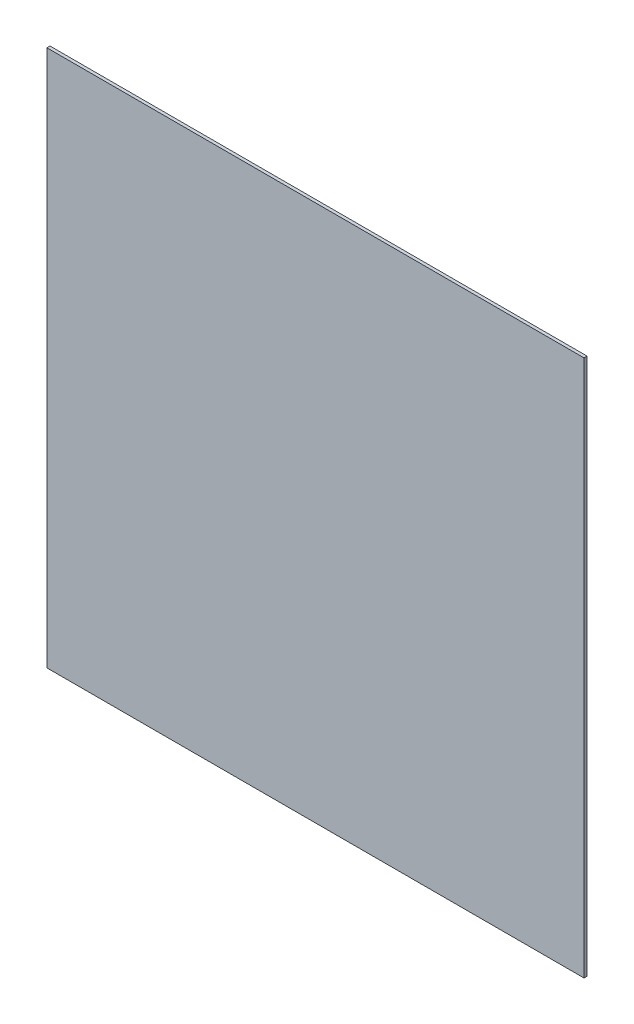
ISO-10303-21;
HEADER;
FILE_DESCRIPTION(('STEP AP214'),'2;1');
FILE_NAME('part.step','',(''),(''),'','','');
FILE_SCHEMA(('AUTOMOTIVE_DESIGN { 1 0 10303 214 1 1 1 1 }'));
ENDSEC;
DATA;
#1=APPLICATION_CONTEXT('core data for automotive mechanical design processes');
#2=APPLICATION_PROTOCOL_DEFINITION('international standard','automotive_design',2000,#1);
#3=PRODUCT_CONTEXT('',#1,'mechanical');
#4=PRODUCT('Part','Part','',(#3));
#5=PRODUCT_RELATED_PRODUCT_CATEGORY('part','',(#4));
#6=PRODUCT_DEFINITION_FORMATION('','',#4);
#7=PRODUCT_DEFINITION_CONTEXT('part definition',#1,'design');
#8=PRODUCT_DEFINITION('design','',#6,#7);
#9=PRODUCT_DEFINITION_SHAPE('','',#8);
#10=(LENGTH_UNIT() NAMED_UNIT(*) SI_UNIT(.MILLI.,.METRE.));
#11=(NAMED_UNIT(*) PLANE_ANGLE_UNIT() SI_UNIT($,.RADIAN.));
#12=(NAMED_UNIT(*) SI_UNIT($,.STERADIAN.) SOLID_ANGLE_UNIT());
#13=UNCERTAINTY_MEASURE_WITH_UNIT(LENGTH_MEASURE(1.E-05),#10,'distance_accuracy_value','');
#14=(GEOMETRIC_REPRESENTATION_CONTEXT(3) GLOBAL_UNCERTAINTY_ASSIGNED_CONTEXT((#13)) GLOBAL_UNIT_ASSIGNED_CONTEXT((#10,
#11,#12)) REPRESENTATION_CONTEXT('',''));
#15=CARTESIAN_POINT('',(0.,0.,0.));
#16=DIRECTION('',(0.,0.,1.));
#17=DIRECTION('',(1.,0.,0.));
#18=AXIS2_PLACEMENT_3D('',#15,#16,#17);
#19=CARTESIAN_POINT('',(-1830.,-1830.,21.));
#20=DIRECTION('',(0.,1.,0.));
#21=DIRECTION('',(0.,0.,1.));
#22=AXIS2_PLACEMENT_3D('',#19,#20,#21);
#23=PLANE('',#22);
#24=DIRECTION('',(1.,0.,0.));
#25=VECTOR('',#24,1.);
#26=CARTESIAN_POINT('',(-1830.,-1830.,0.));
#27=LINE('',#26,#25);
#28=CARTESIAN_POINT('',(-1830.,-1830.,0.));
#29=VERTEX_POINT('',#28);
#30=CARTESIAN_POINT('',(1830.,-1830.,0.));
#31=VERTEX_POINT('',#30);
#32=EDGE_CURVE('E98',#29,#31,#27,.T.);
#33=ORIENTED_EDGE('',*,*,#32,.T.);
#34=DIRECTION('',(0.,0.,-1.));
#35=VECTOR('',#34,1.);
#36=CARTESIAN_POINT('',(1830.,-1830.,21.));
#37=LINE('',#36,#35);
#38=CARTESIAN_POINT('',(1830.,-1830.,21.));
#39=VERTEX_POINT('',#38);
#40=EDGE_CURVE('E11',#39,#31,#37,.T.);
#41=ORIENTED_EDGE('',*,*,#40,.F.);
#42=DIRECTION('',(1.,0.,0.));
#43=VECTOR('',#42,1.);
#44=CARTESIAN_POINT('',(-1830.,-1830.,21.));
#45=LINE('',#44,#43);
#46=CARTESIAN_POINT('',(-1830.,-1830.,21.));
#47=VERTEX_POINT('',#46);
#48=EDGE_CURVE('E84',#47,#39,#45,.T.);
#49=ORIENTED_EDGE('',*,*,#48,.F.);
#50=DIRECTION('',(0.,0.,-1.));
#51=VECTOR('',#50,1.);
#52=CARTESIAN_POINT('',(-1830.,-1830.,21.));
#53=LINE('',#52,#51);
#54=EDGE_CURVE('E51',#47,#29,#53,.T.);
#55=ORIENTED_EDGE('',*,*,#54,.T.);
#56=EDGE_LOOP('',(#33,#41,#49,#55));
#57=FACE_BOUND('',#56,.T.);
#58=ADVANCED_FACE('F35',(#57),#23,.F.);
#59=CARTESIAN_POINT('',(1830.,-1830.,21.));
#60=DIRECTION('',(-1.,0.,0.));
#61=DIRECTION('',(0.,0.,1.));
#62=AXIS2_PLACEMENT_3D('',#59,#60,#61);
#63=PLANE('',#62);
#64=DIRECTION('',(0.,1.,0.));
#65=VECTOR('',#64,1.);
#66=CARTESIAN_POINT('',(1830.,-1830.,0.));
#67=LINE('',#66,#65);
#68=CARTESIAN_POINT('',(1830.,1830.,0.));
#69=VERTEX_POINT('',#68);
#70=EDGE_CURVE('E89',#31,#69,#67,.T.);
#71=ORIENTED_EDGE('',*,*,#70,.T.);
#72=DIRECTION('',(0.,0.,-1.));
#73=VECTOR('',#72,1.);
#74=CARTESIAN_POINT('',(1830.,1830.,21.));
#75=LINE('',#74,#73);
#76=CARTESIAN_POINT('',(1830.,1830.,21.));
#77=VERTEX_POINT('',#76);
#78=EDGE_CURVE('E43',#77,#69,#75,.T.);
#79=ORIENTED_EDGE('',*,*,#78,.F.);
#80=DIRECTION('',(0.,1.,0.));
#81=VECTOR('',#80,1.);
#82=CARTESIAN_POINT('',(1830.,-1830.,21.));
#83=LINE('',#82,#81);
#84=EDGE_CURVE('E76',#39,#77,#83,.T.);
#85=ORIENTED_EDGE('',*,*,#84,.F.);
#86=ORIENTED_EDGE('',*,*,#40,.T.);
#87=EDGE_LOOP('',(#71,#79,#85,#86));
#88=FACE_BOUND('',#87,.T.);
#89=ADVANCED_FACE('F88',(#88),#63,.F.);
#90=CARTESIAN_POINT('',(-1830.,1830.,21.));
#91=DIRECTION('',(0.,1.,0.));
#92=DIRECTION('',(0.,0.,1.));
#93=AXIS2_PLACEMENT_3D('',#90,#91,#92);
#94=PLANE('',#93);
#95=DIRECTION('',(1.,0.,0.));
#96=VECTOR('',#95,1.);
#97=CARTESIAN_POINT('',(-1830.,1830.,0.));
#98=LINE('',#97,#96);
#99=CARTESIAN_POINT('',(-1830.,1830.,0.));
#100=VERTEX_POINT('',#99);
#101=EDGE_CURVE('E101',#100,#69,#98,.T.);
#102=ORIENTED_EDGE('',*,*,#101,.F.);
#103=DIRECTION('',(0.,0.,-1.));
#104=VECTOR('',#103,1.);
#105=CARTESIAN_POINT('',(-1830.,1830.,21.));
#106=LINE('',#105,#104);
#107=CARTESIAN_POINT('',(-1830.,1830.,21.));
#108=VERTEX_POINT('',#107);
#109=EDGE_CURVE('E65',#108,#100,#106,.T.);
#110=ORIENTED_EDGE('',*,*,#109,.F.);
#111=DIRECTION('',(1.,0.,0.));
#112=VECTOR('',#111,1.);
#113=CARTESIAN_POINT('',(-1830.,1830.,21.));
#114=LINE('',#113,#112);
#115=EDGE_CURVE('E83',#108,#77,#114,.T.);
#116=ORIENTED_EDGE('',*,*,#115,.T.);
#117=ORIENTED_EDGE('',*,*,#78,.T.);
#118=EDGE_LOOP('',(#102,#110,#116,#117));
#119=FACE_BOUND('',#118,.T.);
#120=ADVANCED_FACE('F92',(#119),#94,.T.);
#121=CARTESIAN_POINT('',(-1830.,-1830.,21.));
#122=DIRECTION('',(-1.,0.,0.));
#123=DIRECTION('',(0.,0.,1.));
#124=AXIS2_PLACEMENT_3D('',#121,#122,#123);
#125=PLANE('',#124);
#126=DIRECTION('',(0.,1.,0.));
#127=VECTOR('',#126,1.);
#128=CARTESIAN_POINT('',(-1830.,-1830.,0.));
#129=LINE('',#128,#127);
#130=EDGE_CURVE('E103',#29,#100,#129,.T.);
#131=ORIENTED_EDGE('',*,*,#130,.F.);
#132=ORIENTED_EDGE('',*,*,#54,.F.);
#133=DIRECTION('',(0.,1.,0.));
#134=VECTOR('',#133,1.);
#135=CARTESIAN_POINT('',(-1830.,-1830.,21.));
#136=LINE('',#135,#134);
#137=EDGE_CURVE('E93',#47,#108,#136,.T.);
#138=ORIENTED_EDGE('',*,*,#137,.T.);
#139=ORIENTED_EDGE('',*,*,#109,.T.);
#140=EDGE_LOOP('',(#131,#132,#138,#139));
#141=FACE_BOUND('',#140,.T.);
#142=ADVANCED_FACE('F109',(#141),#125,.T.);
#143=CARTESIAN_POINT('',(0.,0.,21.));
#144=DIRECTION('',(0.,0.,1.));
#145=DIRECTION('',(1.,0.,0.));
#146=AXIS2_PLACEMENT_3D('',#143,#144,#145);
#147=PLANE('',#146);
#148=ORIENTED_EDGE('',*,*,#48,.T.);
#149=ORIENTED_EDGE('',*,*,#84,.T.);
#150=ORIENTED_EDGE('',*,*,#115,.F.);
#151=ORIENTED_EDGE('',*,*,#137,.F.);
#152=EDGE_LOOP('',(#148,#149,#150,#151));
#153=FACE_BOUND('',#152,.T.);
#154=ADVANCED_FACE('F80',(#153),#147,.T.);
#155=CARTESIAN_POINT('',(0.,0.,0.));
#156=DIRECTION('',(0.,0.,1.));
#157=DIRECTION('',(1.,0.,0.));
#158=AXIS2_PLACEMENT_3D('',#155,#156,#157);
#159=PLANE('',#158);
#160=ORIENTED_EDGE('',*,*,#32,.F.);
#161=ORIENTED_EDGE('',*,*,#130,.T.);
#162=ORIENTED_EDGE('',*,*,#101,.T.);
#163=ORIENTED_EDGE('',*,*,#70,.F.);
#164=EDGE_LOOP('',(#160,#161,#162,#163));
#165=FACE_BOUND('',#164,.T.);
#166=ADVANCED_FACE('F108',(#165),#159,.F.);
#167=CLOSED_SHELL('',(#58,#89,#120,#142,#154,#166));
#168=MANIFOLD_SOLID_BREP('B2',#167);
#169=ADVANCED_BREP_SHAPE_REPRESENTATION('',(#18,#168),#14);
#170=SHAPE_DEFINITION_REPRESENTATION(#9,#169);
ENDSEC;
END-ISO-10303-21;
